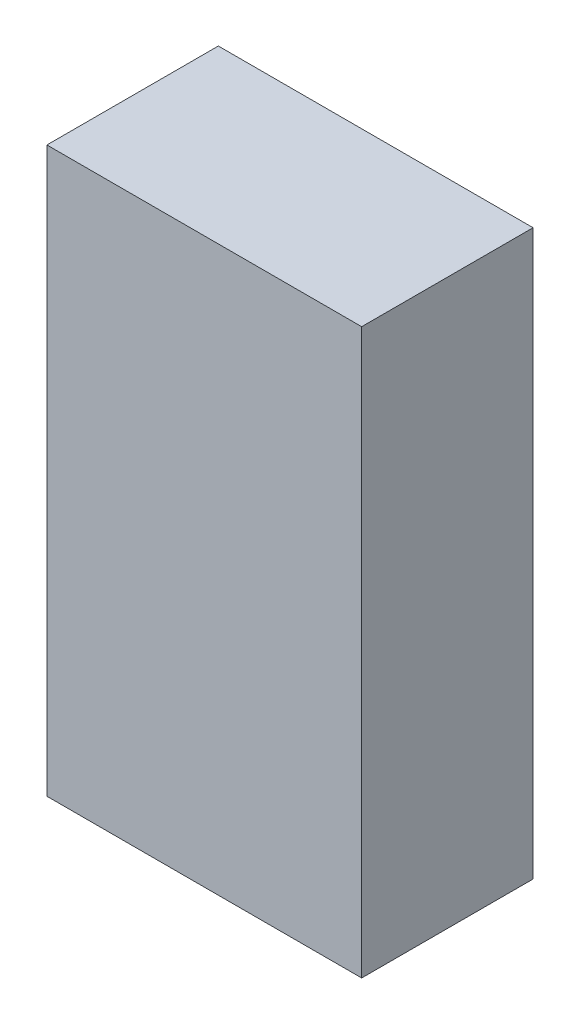
ISO-10303-21;
HEADER;
FILE_DESCRIPTION(('STEP AP214'),'2;1');
FILE_NAME('part.step','',(''),(''),'','','');
FILE_SCHEMA(('AUTOMOTIVE_DESIGN { 1 0 10303 214 1 1 1 1 }'));
ENDSEC;
DATA;
#1=APPLICATION_CONTEXT('core data for automotive mechanical design processes');
#2=APPLICATION_PROTOCOL_DEFINITION('international standard','automotive_design',2000,#1);
#3=PRODUCT_CONTEXT('',#1,'mechanical');
#4=PRODUCT('Part','Part','',(#3));
#5=PRODUCT_RELATED_PRODUCT_CATEGORY('part','',(#4));
#6=PRODUCT_DEFINITION_FORMATION('','',#4);
#7=PRODUCT_DEFINITION_CONTEXT('part definition',#1,'design');
#8=PRODUCT_DEFINITION('design','',#6,#7);
#9=PRODUCT_DEFINITION_SHAPE('','',#8);
#10=(LENGTH_UNIT() NAMED_UNIT(*) SI_UNIT(.MILLI.,.METRE.));
#11=(NAMED_UNIT(*) PLANE_ANGLE_UNIT() SI_UNIT($,.RADIAN.));
#12=(NAMED_UNIT(*) SI_UNIT($,.STERADIAN.) SOLID_ANGLE_UNIT());
#13=UNCERTAINTY_MEASURE_WITH_UNIT(LENGTH_MEASURE(1.E-05),#10,'distance_accuracy_value','');
#14=(GEOMETRIC_REPRESENTATION_CONTEXT(3) GLOBAL_UNCERTAINTY_ASSIGNED_CONTEXT((#13)) GLOBAL_UNIT_ASSIGNED_CONTEXT((#10,
#11,#12)) REPRESENTATION_CONTEXT('',''));
#15=CARTESIAN_POINT('',(0.,0.,0.));
#16=DIRECTION('',(0.,0.,1.));
#17=DIRECTION('',(1.,0.,0.));
#18=AXIS2_PLACEMENT_3D('',#15,#16,#17);
#19=CARTESIAN_POINT('',(0.50499772,-0.90499946,0.5499989));
#20=DIRECTION('',(0.,0.,1.));
#21=DIRECTION('',(1.,0.,0.));
#22=AXIS2_PLACEMENT_3D('',#19,#20,#21);
#23=PLANE('',#22);
#24=DIRECTION('',(0.,-1.,0.));
#25=VECTOR('',#24,1.);
#26=CARTESIAN_POINT('',(0.50499772,0.90499946,0.5499989));
#27=LINE('',#26,#25);
#28=CARTESIAN_POINT('',(0.50499772,0.90499946,0.5499989));
#29=VERTEX_POINT('',#28);
#30=CARTESIAN_POINT('',(0.50499772,-0.90499946,0.5499989));
#31=VERTEX_POINT('',#30);
#32=EDGE_CURVE('E27',#29,#31,#27,.T.);
#33=ORIENTED_EDGE('',*,*,#32,.F.);
#34=DIRECTION('',(1.,0.,0.));
#35=VECTOR('',#34,1.);
#36=CARTESIAN_POINT('',(-0.50499772,0.90499946,0.5499989));
#37=LINE('',#36,#35);
#38=CARTESIAN_POINT('',(-0.50499772,0.90499946,0.5499989));
#39=VERTEX_POINT('',#38);
#40=EDGE_CURVE('E61',#39,#29,#37,.T.);
#41=ORIENTED_EDGE('',*,*,#40,.F.);
#42=DIRECTION('',(0.,1.,0.));
#43=VECTOR('',#42,1.);
#44=CARTESIAN_POINT('',(-0.50499772,-0.90499946,0.5499989));
#45=LINE('',#44,#43);
#46=CARTESIAN_POINT('',(-0.50499772,-0.90499946,0.5499989));
#47=VERTEX_POINT('',#46);
#48=EDGE_CURVE('E87',#47,#39,#45,.T.);
#49=ORIENTED_EDGE('',*,*,#48,.F.);
#50=DIRECTION('',(-1.,0.,0.));
#51=VECTOR('',#50,1.);
#52=CARTESIAN_POINT('',(0.50499772,-0.90499946,0.5499989));
#53=LINE('',#52,#51);
#54=EDGE_CURVE('E109',#31,#47,#53,.T.);
#55=ORIENTED_EDGE('',*,*,#54,.F.);
#56=EDGE_LOOP('',(#33,#41,#49,#55));
#57=FACE_BOUND('',#56,.T.);
#58=ADVANCED_FACE('F17',(#57),#23,.T.);
#59=CARTESIAN_POINT('',(0.50499772,-0.90499946,0.));
#60=DIRECTION('',(0.,0.,1.));
#61=DIRECTION('',(1.,0.,0.));
#62=AXIS2_PLACEMENT_3D('',#59,#60,#61);
#63=PLANE('',#62);
#64=DIRECTION('',(-1.,0.,0.));
#65=VECTOR('',#64,1.);
#66=CARTESIAN_POINT('',(0.50499772,-0.90499946,0.));
#67=LINE('',#66,#65);
#68=CARTESIAN_POINT('',(0.50499772,-0.90499946,0.));
#69=VERTEX_POINT('',#68);
#70=CARTESIAN_POINT('',(-0.50499772,-0.90499946,0.));
#71=VERTEX_POINT('',#70);
#72=EDGE_CURVE('E80',#69,#71,#67,.T.);
#73=ORIENTED_EDGE('',*,*,#72,.T.);
#74=DIRECTION('',(0.,1.,0.));
#75=VECTOR('',#74,1.);
#76=CARTESIAN_POINT('',(-0.50499772,-0.90499946,0.));
#77=LINE('',#76,#75);
#78=CARTESIAN_POINT('',(-0.50499772,0.90499946,0.));
#79=VERTEX_POINT('',#78);
#80=EDGE_CURVE('E77',#71,#79,#77,.T.);
#81=ORIENTED_EDGE('',*,*,#80,.T.);
#82=DIRECTION('',(1.,0.,0.));
#83=VECTOR('',#82,1.);
#84=CARTESIAN_POINT('',(-0.50499772,0.90499946,0.));
#85=LINE('',#84,#83);
#86=CARTESIAN_POINT('',(0.50499772,0.90499946,0.));
#87=VERTEX_POINT('',#86);
#88=EDGE_CURVE('E20',#79,#87,#85,.T.);
#89=ORIENTED_EDGE('',*,*,#88,.T.);
#90=DIRECTION('',(0.,-1.,0.));
#91=VECTOR('',#90,1.);
#92=CARTESIAN_POINT('',(0.50499772,0.90499946,0.));
#93=LINE('',#92,#91);
#94=EDGE_CURVE('E11',#87,#69,#93,.T.);
#95=ORIENTED_EDGE('',*,*,#94,.T.);
#96=EDGE_LOOP('',(#73,#81,#89,#95));
#97=FACE_BOUND('',#96,.T.);
#98=ADVANCED_FACE('F78',(#97),#63,.F.);
#99=CARTESIAN_POINT('',(0.50499772,0.90499946,0.));
#100=DIRECTION('',(1.,0.,0.));
#101=DIRECTION('',(0.,1.,0.));
#102=AXIS2_PLACEMENT_3D('',#99,#100,#101);
#103=PLANE('',#102);
#104=DIRECTION('',(0.,0.,1.));
#105=VECTOR('',#104,1.);
#106=CARTESIAN_POINT('',(0.50499772,0.90499946,0.));
#107=LINE('',#106,#105);
#108=EDGE_CURVE('E73',#87,#29,#107,.T.);
#109=ORIENTED_EDGE('',*,*,#108,.T.);
#110=ORIENTED_EDGE('',*,*,#32,.T.);
#111=DIRECTION('',(0.,0.,1.));
#112=VECTOR('',#111,1.);
#113=CARTESIAN_POINT('',(0.50499772,-0.90499946,0.));
#114=LINE('',#113,#112);
#115=EDGE_CURVE('E108',#69,#31,#114,.T.);
#116=ORIENTED_EDGE('',*,*,#115,.F.);
#117=ORIENTED_EDGE('',*,*,#94,.F.);
#118=EDGE_LOOP('',(#109,#110,#116,#117));
#119=FACE_BOUND('',#118,.T.);
#120=ADVANCED_FACE('F140',(#119),#103,.T.);
#121=CARTESIAN_POINT('',(-0.50499772,0.90499946,0.));
#122=DIRECTION('',(0.,1.,0.));
#123=DIRECTION('',(1.,0.,0.));
#124=AXIS2_PLACEMENT_3D('',#121,#122,#123);
#125=PLANE('',#124);
#126=DIRECTION('',(0.,0.,1.));
#127=VECTOR('',#126,1.);
#128=CARTESIAN_POINT('',(-0.50499772,0.90499946,0.));
#129=LINE('',#128,#127);
#130=EDGE_CURVE('E71',#79,#39,#129,.T.);
#131=ORIENTED_EDGE('',*,*,#130,.T.);
#132=ORIENTED_EDGE('',*,*,#40,.T.);
#133=ORIENTED_EDGE('',*,*,#108,.F.);
#134=ORIENTED_EDGE('',*,*,#88,.F.);
#135=EDGE_LOOP('',(#131,#132,#133,#134));
#136=FACE_BOUND('',#135,.T.);
#137=ADVANCED_FACE('F69',(#136),#125,.T.);
#138=CARTESIAN_POINT('',(-0.50499772,-0.90499946,0.));
#139=DIRECTION('',(-1.,0.,0.));
#140=DIRECTION('',(0.,0.,1.));
#141=AXIS2_PLACEMENT_3D('',#138,#139,#140);
#142=PLANE('',#141);
#143=DIRECTION('',(0.,0.,1.));
#144=VECTOR('',#143,1.);
#145=CARTESIAN_POINT('',(-0.50499772,-0.90499946,0.));
#146=LINE('',#145,#144);
#147=EDGE_CURVE('E113',#71,#47,#146,.T.);
#148=ORIENTED_EDGE('',*,*,#147,.T.);
#149=ORIENTED_EDGE('',*,*,#48,.T.);
#150=ORIENTED_EDGE('',*,*,#130,.F.);
#151=ORIENTED_EDGE('',*,*,#80,.F.);
#152=EDGE_LOOP('',(#148,#149,#150,#151));
#153=FACE_BOUND('',#152,.T.);
#154=ADVANCED_FACE('F86',(#153),#142,.T.);
#155=CARTESIAN_POINT('',(0.50499772,-0.90499946,0.));
#156=DIRECTION('',(0.,-1.,0.));
#157=DIRECTION('',(0.,0.,-1.));
#158=AXIS2_PLACEMENT_3D('',#155,#156,#157);
#159=PLANE('',#158);
#160=ORIENTED_EDGE('',*,*,#115,.T.);
#161=ORIENTED_EDGE('',*,*,#54,.T.);
#162=ORIENTED_EDGE('',*,*,#147,.F.);
#163=ORIENTED_EDGE('',*,*,#72,.F.);
#164=EDGE_LOOP('',(#160,#161,#162,#163));
#165=FACE_BOUND('',#164,.T.);
#166=ADVANCED_FACE('F137',(#165),#159,.T.);
#167=CLOSED_SHELL('',(#58,#98,#120,#137,#154,#166));
#168=MANIFOLD_SOLID_BREP('B1',#167);
#169=ADVANCED_BREP_SHAPE_REPRESENTATION('',(#18,#168),#14);
#170=SHAPE_DEFINITION_REPRESENTATION(#9,#169);
ENDSEC;
END-ISO-10303-21;
